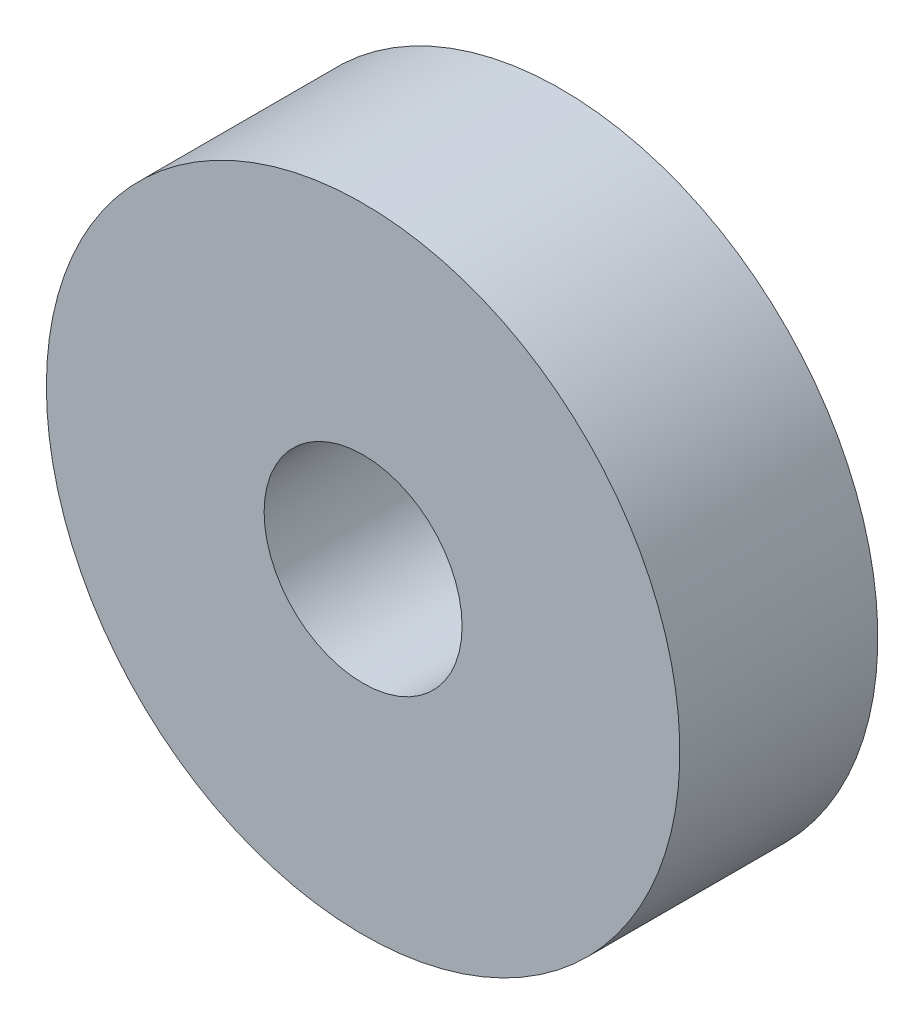
ISO-10303-21;
HEADER;
FILE_DESCRIPTION(('STEP AP214'),'2;1');
FILE_NAME('part.step','',(''),(''),'','','');
FILE_SCHEMA(('AUTOMOTIVE_DESIGN { 1 0 10303 214 1 1 1 1 }'));
ENDSEC;
DATA;
#1=APPLICATION_CONTEXT('core data for automotive mechanical design processes');
#2=APPLICATION_PROTOCOL_DEFINITION('international standard','automotive_design',2000,#1);
#3=PRODUCT_CONTEXT('',#1,'mechanical');
#4=PRODUCT('Part','Part','',(#3));
#5=PRODUCT_RELATED_PRODUCT_CATEGORY('part','',(#4));
#6=PRODUCT_DEFINITION_FORMATION('','',#4);
#7=PRODUCT_DEFINITION_CONTEXT('part definition',#1,'design');
#8=PRODUCT_DEFINITION('design','',#6,#7);
#9=PRODUCT_DEFINITION_SHAPE('','',#8);
#10=(LENGTH_UNIT() NAMED_UNIT(*) SI_UNIT(.MILLI.,.METRE.));
#11=(NAMED_UNIT(*) PLANE_ANGLE_UNIT() SI_UNIT($,.RADIAN.));
#12=(NAMED_UNIT(*) SI_UNIT($,.STERADIAN.) SOLID_ANGLE_UNIT());
#13=UNCERTAINTY_MEASURE_WITH_UNIT(LENGTH_MEASURE(1.E-05),#10,'distance_accuracy_value','');
#14=(GEOMETRIC_REPRESENTATION_CONTEXT(3) GLOBAL_UNCERTAINTY_ASSIGNED_CONTEXT((#13)) GLOBAL_UNIT_ASSIGNED_CONTEXT((#10,
#11,#12)) REPRESENTATION_CONTEXT('',''));
#15=CARTESIAN_POINT('',(0.,0.,0.));
#16=DIRECTION('',(0.,0.,1.));
#17=DIRECTION('',(1.,0.,0.));
#18=AXIS2_PLACEMENT_3D('',#15,#16,#17);
#19=CARTESIAN_POINT('',(0.,0.,0.));
#20=DIRECTION('',(0.,0.,1.));
#21=DIRECTION('',(1.,0.,0.));
#22=AXIS2_PLACEMENT_3D('',#19,#20,#21);
#23=PLANE('',#22);
#24=CARTESIAN_POINT('',(0.,0.,0.));
#25=DIRECTION('',(0.,0.,-1.));
#26=DIRECTION('',(-1.,0.,0.));
#27=AXIS2_PLACEMENT_3D('',#24,#25,#26);
#28=CIRCLE('',#27,2.5);
#29=CARTESIAN_POINT('',(-2.5,0.,0.));
#30=VERTEX_POINT('',#29);
#31=EDGE_CURVE('E27',#30,#30,#28,.F.);
#32=ORIENTED_EDGE('',*,*,#31,.T.);
#33=EDGE_LOOP('',(#32));
#34=FACE_BOUND('',#33,.T.);
#35=CARTESIAN_POINT('',(0.,0.,0.));
#36=DIRECTION('',(0.,0.,-1.));
#37=DIRECTION('',(-1.,0.,0.));
#38=AXIS2_PLACEMENT_3D('',#35,#36,#37);
#39=CIRCLE('',#38,8.);
#40=CARTESIAN_POINT('',(-8.,0.,0.));
#41=VERTEX_POINT('',#40);
#42=EDGE_CURVE('E18',#41,#41,#39,.F.);
#43=ORIENTED_EDGE('',*,*,#42,.F.);
#44=EDGE_LOOP('',(#43));
#45=FACE_BOUND('',#44,.T.);
#46=ADVANCED_FACE('F15',(#34,#45),#23,.F.);
#47=CARTESIAN_POINT('',(0.,0.,5.));
#48=DIRECTION('',(0.,0.,-1.));
#49=DIRECTION('',(-1.,0.,0.));
#50=AXIS2_PLACEMENT_3D('',#47,#48,#49);
#51=CYLINDRICAL_SURFACE('',#50,8.);
#52=ORIENTED_EDGE('',*,*,#42,.T.);
#53=EDGE_LOOP('',(#52));
#54=FACE_BOUND('',#53,.T.);
#55=CARTESIAN_POINT('',(0.,0.,5.));
#56=DIRECTION('',(0.,0.,-1.));
#57=DIRECTION('',(-1.,0.,0.));
#58=AXIS2_PLACEMENT_3D('',#55,#56,#57);
#59=CIRCLE('',#58,8.);
#60=CARTESIAN_POINT('',(-8.,0.,5.));
#61=VERTEX_POINT('',#60);
#62=EDGE_CURVE('E22',#61,#61,#59,.F.);
#63=ORIENTED_EDGE('',*,*,#62,.F.);
#64=EDGE_LOOP('',(#63));
#65=FACE_BOUND('',#64,.T.);
#66=ADVANCED_FACE('F35',(#54,#65),#51,.T.);
#67=CARTESIAN_POINT('',(0.,0.,5.));
#68=DIRECTION('',(0.,0.,-1.));
#69=DIRECTION('',(-1.,0.,0.));
#70=AXIS2_PLACEMENT_3D('',#67,#68,#69);
#71=CYLINDRICAL_SURFACE('',#70,2.5);
#72=CARTESIAN_POINT('',(0.,0.,5.));
#73=DIRECTION('',(0.,0.,-1.));
#74=DIRECTION('',(-1.,0.,0.));
#75=AXIS2_PLACEMENT_3D('',#72,#73,#74);
#76=CIRCLE('',#75,2.5);
#77=CARTESIAN_POINT('',(-2.5,0.,5.));
#78=VERTEX_POINT('',#77);
#79=EDGE_CURVE('E10',#78,#78,#76,.T.);
#80=ORIENTED_EDGE('',*,*,#79,.F.);
#81=EDGE_LOOP('',(#80));
#82=FACE_BOUND('',#81,.T.);
#83=ORIENTED_EDGE('',*,*,#31,.F.);
#84=EDGE_LOOP('',(#83));
#85=FACE_BOUND('',#84,.T.);
#86=ADVANCED_FACE('F43',(#82,#85),#71,.F.);
#87=CARTESIAN_POINT('',(0.,0.,5.));
#88=DIRECTION('',(0.,0.,1.));
#89=DIRECTION('',(1.,0.,0.));
#90=AXIS2_PLACEMENT_3D('',#87,#88,#89);
#91=PLANE('',#90);
#92=ORIENTED_EDGE('',*,*,#79,.T.);
#93=EDGE_LOOP('',(#92));
#94=FACE_BOUND('',#93,.T.);
#95=ORIENTED_EDGE('',*,*,#62,.T.);
#96=EDGE_LOOP('',(#95));
#97=FACE_BOUND('',#96,.T.);
#98=ADVANCED_FACE('F44',(#94,#97),#91,.T.);
#99=CLOSED_SHELL('',(#46,#66,#86,#98));
#100=MANIFOLD_SOLID_BREP('B1',#99);
#101=ADVANCED_BREP_SHAPE_REPRESENTATION('',(#18,#100),#14);
#102=SHAPE_DEFINITION_REPRESENTATION(#9,#101);
ENDSEC;
END-ISO-10303-21;
